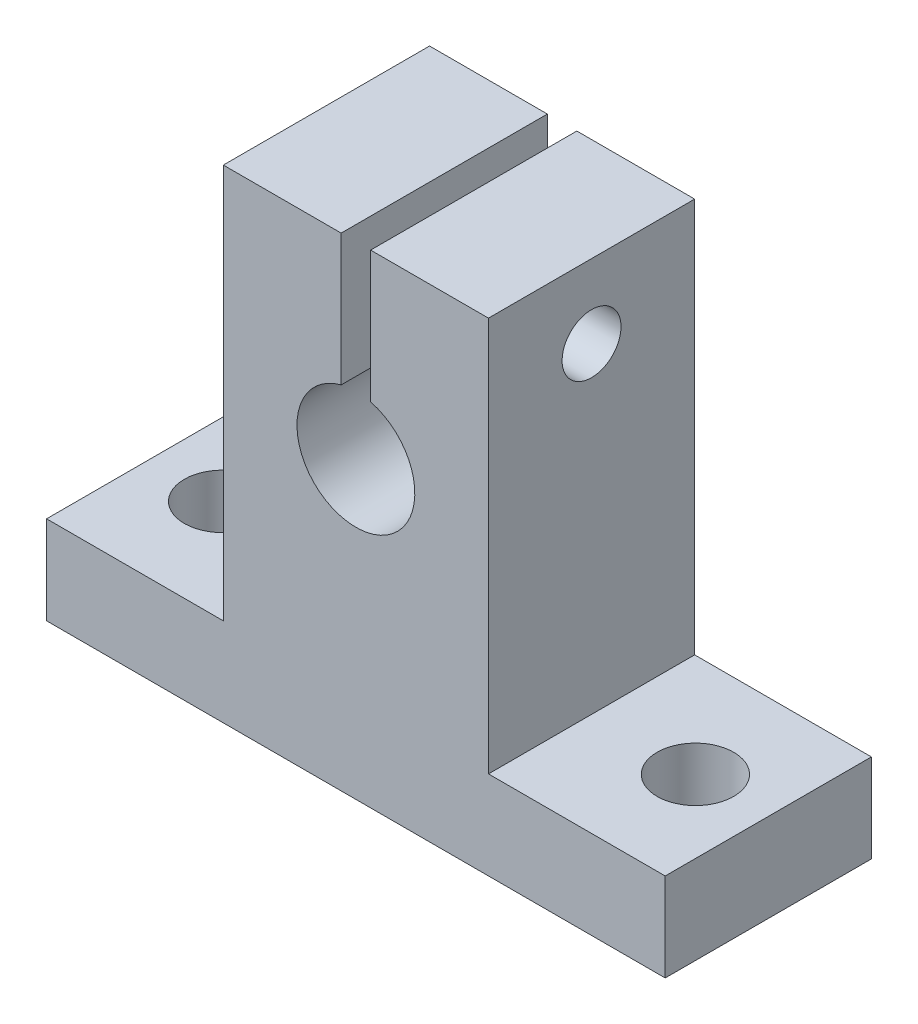
ISO-10303-21;
HEADER;
FILE_DESCRIPTION(('STEP AP214'),'2;1');
FILE_NAME('part.step','',(''),(''),'','','');
FILE_SCHEMA(('AUTOMOTIVE_DESIGN { 1 0 10303 214 1 1 1 1 }'));
ENDSEC;
DATA;
#1=APPLICATION_CONTEXT('core data for automotive mechanical design processes');
#2=APPLICATION_PROTOCOL_DEFINITION('international standard','automotive_design',2000,#1);
#3=PRODUCT_CONTEXT('',#1,'mechanical');
#4=PRODUCT('Part','Part','',(#3));
#5=PRODUCT_RELATED_PRODUCT_CATEGORY('part','',(#4));
#6=PRODUCT_DEFINITION_FORMATION('','',#4);
#7=PRODUCT_DEFINITION_CONTEXT('part definition',#1,'design');
#8=PRODUCT_DEFINITION('design','',#6,#7);
#9=PRODUCT_DEFINITION_SHAPE('','',#8);
#10=(LENGTH_UNIT() NAMED_UNIT(*) SI_UNIT(.MILLI.,.METRE.));
#11=(NAMED_UNIT(*) PLANE_ANGLE_UNIT() SI_UNIT($,.RADIAN.));
#12=(NAMED_UNIT(*) SI_UNIT($,.STERADIAN.) SOLID_ANGLE_UNIT());
#13=UNCERTAINTY_MEASURE_WITH_UNIT(LENGTH_MEASURE(1.E-05),#10,'distance_accuracy_value','');
#14=(GEOMETRIC_REPRESENTATION_CONTEXT(3) GLOBAL_UNCERTAINTY_ASSIGNED_CONTEXT((#13)) GLOBAL_UNIT_ASSIGNED_CONTEXT((#10,
#11,#12)) REPRESENTATION_CONTEXT('',''));
#15=CARTESIAN_POINT('',(0.,0.,0.));
#16=DIRECTION('',(0.,0.,1.));
#17=DIRECTION('',(1.,0.,0.));
#18=AXIS2_PLACEMENT_3D('',#15,#16,#17);
#19=CARTESIAN_POINT('',(-9.,32.8,14.));
#20=DIRECTION('',(0.,-1.,0.));
#21=DIRECTION('',(0.,0.,-1.));
#22=AXIS2_PLACEMENT_3D('',#19,#20,#21);
#23=PLANE('',#22);
#24=DIRECTION('',(-1.,0.,0.));
#25=VECTOR('',#24,1.);
#26=CARTESIAN_POINT('',(-9.,32.8,0.));
#27=LINE('',#26,#25);
#28=CARTESIAN_POINT('',(9.,32.8,0.));
#29=VERTEX_POINT('',#28);
#30=CARTESIAN_POINT('',(1.,32.8,0.));
#31=VERTEX_POINT('',#30);
#32=EDGE_CURVE('E158',#29,#31,#27,.T.);
#33=ORIENTED_EDGE('',*,*,#32,.T.);
#34=DIRECTION('',(0.,0.,1.));
#35=VECTOR('',#34,1.);
#36=CARTESIAN_POINT('',(1.,32.8,0.));
#37=LINE('',#36,#35);
#38=CARTESIAN_POINT('',(1.,32.8,14.));
#39=VERTEX_POINT('',#38);
#40=EDGE_CURVE('E244',#31,#39,#37,.T.);
#41=ORIENTED_EDGE('',*,*,#40,.T.);
#42=DIRECTION('',(-1.,0.,0.));
#43=VECTOR('',#42,1.);
#44=CARTESIAN_POINT('',(-9.,32.8,14.));
#45=LINE('',#44,#43);
#46=CARTESIAN_POINT('',(9.,32.8,14.));
#47=VERTEX_POINT('',#46);
#48=EDGE_CURVE('E108',#47,#39,#45,.T.);
#49=ORIENTED_EDGE('',*,*,#48,.F.);
#50=DIRECTION('',(0.,0.,-1.));
#51=VECTOR('',#50,1.);
#52=CARTESIAN_POINT('',(9.,32.8,14.));
#53=LINE('',#52,#51);
#54=EDGE_CURVE('E11',#47,#29,#53,.T.);
#55=ORIENTED_EDGE('',*,*,#54,.T.);
#56=EDGE_LOOP('',(#33,#41,#49,#55));
#57=FACE_BOUND('',#56,.T.);
#58=ADVANCED_FACE('F41',(#57),#23,.F.);
#59=CARTESIAN_POINT('',(9.00000000000001,6.,14.));
#60=DIRECTION('',(-1.,0.,0.));
#61=DIRECTION('',(0.,-1.,0.));
#62=AXIS2_PLACEMENT_3D('',#59,#60,#61);
#63=PLANE('',#62);
#64=CARTESIAN_POINT('',(9.,27.8,7.));
#65=DIRECTION('',(-1.,0.,0.));
#66=DIRECTION('',(0.,-1.,0.));
#67=AXIS2_PLACEMENT_3D('',#64,#65,#66);
#68=CIRCLE('',#67,2.);
#69=CARTESIAN_POINT('',(9.,25.8,7.));
#70=VERTEX_POINT('',#69);
#71=EDGE_CURVE('E261',#70,#70,#68,.T.);
#72=ORIENTED_EDGE('',*,*,#71,.T.);
#73=EDGE_LOOP('',(#72));
#74=FACE_BOUND('',#73,.T.);
#75=DIRECTION('',(0.,1.,0.));
#76=VECTOR('',#75,1.);
#77=CARTESIAN_POINT('',(9.00000000000001,6.,0.));
#78=LINE('',#77,#76);
#79=CARTESIAN_POINT('',(9.00000000000001,6.,0.));
#80=VERTEX_POINT('',#79);
#81=EDGE_CURVE('E153',#80,#29,#78,.T.);
#82=ORIENTED_EDGE('',*,*,#81,.T.);
#83=ORIENTED_EDGE('',*,*,#54,.F.);
#84=DIRECTION('',(0.,1.,0.));
#85=VECTOR('',#84,1.);
#86=CARTESIAN_POINT('',(9.00000000000001,6.,14.));
#87=LINE('',#86,#85);
#88=CARTESIAN_POINT('',(9.00000000000001,6.,14.));
#89=VERTEX_POINT('',#88);
#90=EDGE_CURVE('E171',#89,#47,#87,.T.);
#91=ORIENTED_EDGE('',*,*,#90,.F.);
#92=DIRECTION('',(0.,0.,-1.));
#93=VECTOR('',#92,1.);
#94=CARTESIAN_POINT('',(9.00000000000001,6.,14.));
#95=LINE('',#94,#93);
#96=EDGE_CURVE('E149',#89,#80,#95,.T.);
#97=ORIENTED_EDGE('',*,*,#96,.T.);
#98=EDGE_LOOP('',(#82,#83,#91,#97));
#99=FACE_BOUND('',#98,.T.);
#100=ADVANCED_FACE('F43',(#74,#99),#63,.F.);
#101=CARTESIAN_POINT('',(-1.,32.8,14.));
#102=VERTEX_POINT('',#101);
#103=CARTESIAN_POINT('',(-9.,32.8,14.));
#104=VERTEX_POINT('',#103);
#105=EDGE_CURVE('E197',#102,#104,#45,.T.);
#106=ORIENTED_EDGE('',*,*,#105,.F.);
#107=DIRECTION('',(0.,0.,1.));
#108=VECTOR('',#107,1.);
#109=CARTESIAN_POINT('',(-1.,32.8,0.));
#110=LINE('',#109,#108);
#111=CARTESIAN_POINT('',(-1.,32.8,0.));
#112=VERTEX_POINT('',#111);
#113=EDGE_CURVE('E249',#112,#102,#110,.T.);
#114=ORIENTED_EDGE('',*,*,#113,.F.);
#115=CARTESIAN_POINT('',(-9.,32.8,0.));
#116=VERTEX_POINT('',#115);
#117=EDGE_CURVE('E156',#112,#116,#27,.T.);
#118=ORIENTED_EDGE('',*,*,#117,.T.);
#119=DIRECTION('',(0.,0.,-1.));
#120=VECTOR('',#119,1.);
#121=CARTESIAN_POINT('',(-9.,32.8,14.));
#122=LINE('',#121,#120);
#123=EDGE_CURVE('E50',#104,#116,#122,.T.);
#124=ORIENTED_EDGE('',*,*,#123,.F.);
#125=EDGE_LOOP('',(#106,#114,#118,#124));
#126=FACE_BOUND('',#125,.T.);
#127=ADVANCED_FACE('F273',(#126),#23,.F.);
#128=CARTESIAN_POINT('',(-9.,6.,14.));
#129=DIRECTION('',(1.,0.,0.));
#130=DIRECTION('',(0.,0.,-1.));
#131=AXIS2_PLACEMENT_3D('',#128,#129,#130);
#132=PLANE('',#131);
#133=CARTESIAN_POINT('',(-9.,27.8,7.));
#134=DIRECTION('',(-1.,0.,0.));
#135=DIRECTION('',(0.,0.,1.));
#136=AXIS2_PLACEMENT_3D('',#133,#134,#135);
#137=CIRCLE('',#136,2.);
#138=CARTESIAN_POINT('',(-9.,27.8,9.));
#139=VERTEX_POINT('',#138);
#140=EDGE_CURVE('E301',#139,#139,#137,.T.);
#141=ORIENTED_EDGE('',*,*,#140,.F.);
#142=EDGE_LOOP('',(#141));
#143=FACE_BOUND('',#142,.T.);
#144=DIRECTION('',(0.,-1.,0.));
#145=VECTOR('',#144,1.);
#146=CARTESIAN_POINT('',(-9.,6.,0.));
#147=LINE('',#146,#145);
#148=CARTESIAN_POINT('',(-9.,6.,0.));
#149=VERTEX_POINT('',#148);
#150=EDGE_CURVE('E161',#116,#149,#147,.T.);
#151=ORIENTED_EDGE('',*,*,#150,.T.);
#152=DIRECTION('',(0.,0.,-1.));
#153=VECTOR('',#152,1.);
#154=CARTESIAN_POINT('',(-9.,6.,14.));
#155=LINE('',#154,#153);
#156=CARTESIAN_POINT('',(-9.,6.,14.));
#157=VERTEX_POINT('',#156);
#158=EDGE_CURVE('E178',#157,#149,#155,.T.);
#159=ORIENTED_EDGE('',*,*,#158,.F.);
#160=DIRECTION('',(0.,-1.,0.));
#161=VECTOR('',#160,1.);
#162=CARTESIAN_POINT('',(-9.,6.,14.));
#163=LINE('',#162,#161);
#164=EDGE_CURVE('E199',#104,#157,#163,.T.);
#165=ORIENTED_EDGE('',*,*,#164,.F.);
#166=ORIENTED_EDGE('',*,*,#123,.T.);
#167=EDGE_LOOP('',(#151,#159,#165,#166));
#168=FACE_BOUND('',#167,.T.);
#169=ADVANCED_FACE('F276',(#143,#168),#132,.F.);
#170=CARTESIAN_POINT('',(-9.,6.,14.));
#171=DIRECTION('',(0.,-1.,0.));
#172=DIRECTION('',(1.,0.,0.));
#173=AXIS2_PLACEMENT_3D('',#170,#171,#172);
#174=PLANE('',#173);
#175=CARTESIAN_POINT('',(-16.05,6.,7.));
#176=DIRECTION('',(0.,1.,0.));
#177=DIRECTION('',(-1.,0.,0.));
#178=AXIS2_PLACEMENT_3D('',#175,#176,#177);
#179=CIRCLE('',#178,2.6);
#180=CARTESIAN_POINT('',(-18.65,6.,7.));
#181=VERTEX_POINT('',#180);
#182=EDGE_CURVE('E187',#181,#181,#179,.T.);
#183=ORIENTED_EDGE('',*,*,#182,.F.);
#184=EDGE_LOOP('',(#183));
#185=FACE_BOUND('',#184,.T.);
#186=DIRECTION('',(-1.,0.,0.));
#187=VECTOR('',#186,1.);
#188=CARTESIAN_POINT('',(-9.,6.,0.));
#189=LINE('',#188,#187);
#190=CARTESIAN_POINT('',(-21.,5.99999999999999,0.));
#191=VERTEX_POINT('',#190);
#192=EDGE_CURVE('E163',#149,#191,#189,.T.);
#193=ORIENTED_EDGE('',*,*,#192,.T.);
#194=DIRECTION('',(0.,0.,-1.));
#195=VECTOR('',#194,1.);
#196=CARTESIAN_POINT('',(-21.,5.99999999999999,14.));
#197=LINE('',#196,#195);
#198=CARTESIAN_POINT('',(-21.,5.99999999999999,14.));
#199=VERTEX_POINT('',#198);
#200=EDGE_CURVE('E175',#199,#191,#197,.T.);
#201=ORIENTED_EDGE('',*,*,#200,.F.);
#202=DIRECTION('',(-1.,0.,0.));
#203=VECTOR('',#202,1.);
#204=CARTESIAN_POINT('',(-9.,6.,14.));
#205=LINE('',#204,#203);
#206=EDGE_CURVE('E201',#157,#199,#205,.T.);
#207=ORIENTED_EDGE('',*,*,#206,.F.);
#208=ORIENTED_EDGE('',*,*,#158,.T.);
#209=EDGE_LOOP('',(#193,#201,#207,#208));
#210=FACE_BOUND('',#209,.T.);
#211=ADVANCED_FACE('F207',(#185,#210),#174,.F.);
#212=CARTESIAN_POINT('',(-21.,0.,14.));
#213=DIRECTION('',(1.,0.,0.));
#214=DIRECTION('',(0.,0.,-1.));
#215=AXIS2_PLACEMENT_3D('',#212,#213,#214);
#216=PLANE('',#215);
#217=DIRECTION('',(0.,-1.,0.));
#218=VECTOR('',#217,1.);
#219=CARTESIAN_POINT('',(-21.,0.,0.));
#220=LINE('',#219,#218);
#221=CARTESIAN_POINT('',(-21.,0.,0.));
#222=VERTEX_POINT('',#221);
#223=EDGE_CURVE('E165',#191,#222,#220,.T.);
#224=ORIENTED_EDGE('',*,*,#223,.T.);
#225=DIRECTION('',(0.,0.,-1.));
#226=VECTOR('',#225,1.);
#227=CARTESIAN_POINT('',(-21.,0.,14.));
#228=LINE('',#227,#226);
#229=CARTESIAN_POINT('',(-21.,0.,14.));
#230=VERTEX_POINT('',#229);
#231=EDGE_CURVE('E144',#230,#222,#228,.T.);
#232=ORIENTED_EDGE('',*,*,#231,.F.);
#233=DIRECTION('',(0.,-1.,0.));
#234=VECTOR('',#233,1.);
#235=CARTESIAN_POINT('',(-21.,0.,14.));
#236=LINE('',#235,#234);
#237=EDGE_CURVE('E132',#199,#230,#236,.T.);
#238=ORIENTED_EDGE('',*,*,#237,.F.);
#239=ORIENTED_EDGE('',*,*,#200,.T.);
#240=EDGE_LOOP('',(#224,#232,#238,#239));
#241=FACE_BOUND('',#240,.T.);
#242=ADVANCED_FACE('F211',(#241),#216,.F.);
#243=CARTESIAN_POINT('',(21.,0.,14.));
#244=DIRECTION('',(0.,1.,0.));
#245=DIRECTION('',(-1.,0.,0.));
#246=AXIS2_PLACEMENT_3D('',#243,#244,#245);
#247=PLANE('',#246);
#248=CARTESIAN_POINT('',(-16.05,0.,7.));
#249=DIRECTION('',(0.,1.,0.));
#250=DIRECTION('',(-1.,0.,0.));
#251=AXIS2_PLACEMENT_3D('',#248,#249,#250);
#252=CIRCLE('',#251,2.6);
#253=CARTESIAN_POINT('',(-18.65,0.,7.));
#254=VERTEX_POINT('',#253);
#255=EDGE_CURVE('E157',#254,#254,#252,.T.);
#256=ORIENTED_EDGE('',*,*,#255,.T.);
#257=EDGE_LOOP('',(#256));
#258=FACE_BOUND('',#257,.T.);
#259=CARTESIAN_POINT('',(16.05,0.,7.));
#260=DIRECTION('',(0.,1.,0.));
#261=DIRECTION('',(-1.,0.,0.));
#262=AXIS2_PLACEMENT_3D('',#259,#260,#261);
#263=CIRCLE('',#262,2.6);
#264=CARTESIAN_POINT('',(13.45,0.,7.));
#265=VERTEX_POINT('',#264);
#266=EDGE_CURVE('E183',#265,#265,#263,.T.);
#267=ORIENTED_EDGE('',*,*,#266,.T.);
#268=EDGE_LOOP('',(#267));
#269=FACE_BOUND('',#268,.T.);
#270=DIRECTION('',(1.,0.,0.));
#271=VECTOR('',#270,1.);
#272=CARTESIAN_POINT('',(21.,0.,0.));
#273=LINE('',#272,#271);
#274=CARTESIAN_POINT('',(21.,0.,0.));
#275=VERTEX_POINT('',#274);
#276=EDGE_CURVE('E141',#222,#275,#273,.T.);
#277=ORIENTED_EDGE('',*,*,#276,.T.);
#278=DIRECTION('',(0.,0.,-1.));
#279=VECTOR('',#278,1.);
#280=CARTESIAN_POINT('',(21.,0.,14.));
#281=LINE('',#280,#279);
#282=CARTESIAN_POINT('',(21.,0.,14.));
#283=VERTEX_POINT('',#282);
#284=EDGE_CURVE('E138',#283,#275,#281,.T.);
#285=ORIENTED_EDGE('',*,*,#284,.F.);
#286=DIRECTION('',(1.,0.,0.));
#287=VECTOR('',#286,1.);
#288=CARTESIAN_POINT('',(21.,0.,14.));
#289=LINE('',#288,#287);
#290=EDGE_CURVE('E125',#230,#283,#289,.T.);
#291=ORIENTED_EDGE('',*,*,#290,.F.);
#292=ORIENTED_EDGE('',*,*,#231,.T.);
#293=EDGE_LOOP('',(#277,#285,#291,#292));
#294=FACE_BOUND('',#293,.T.);
#295=ADVANCED_FACE('F139',(#258,#269,#294),#247,.F.);
#296=CARTESIAN_POINT('',(21.,0.,14.));
#297=DIRECTION('',(-1.,0.,0.));
#298=DIRECTION('',(0.,0.,1.));
#299=AXIS2_PLACEMENT_3D('',#296,#297,#298);
#300=PLANE('',#299);
#301=DIRECTION('',(0.,1.,0.));
#302=VECTOR('',#301,1.);
#303=CARTESIAN_POINT('',(21.,0.,0.));
#304=LINE('',#303,#302);
#305=CARTESIAN_POINT('',(21.,6.,0.));
#306=VERTEX_POINT('',#305);
#307=EDGE_CURVE('E168',#275,#306,#304,.T.);
#308=ORIENTED_EDGE('',*,*,#307,.T.);
#309=DIRECTION('',(0.,0.,-1.));
#310=VECTOR('',#309,1.);
#311=CARTESIAN_POINT('',(21.,6.,14.));
#312=LINE('',#311,#310);
#313=CARTESIAN_POINT('',(21.,6.,14.));
#314=VERTEX_POINT('',#313);
#315=EDGE_CURVE('E145',#314,#306,#312,.T.);
#316=ORIENTED_EDGE('',*,*,#315,.F.);
#317=DIRECTION('',(0.,1.,0.));
#318=VECTOR('',#317,1.);
#319=CARTESIAN_POINT('',(21.,0.,14.));
#320=LINE('',#319,#318);
#321=EDGE_CURVE('E129',#283,#314,#320,.T.);
#322=ORIENTED_EDGE('',*,*,#321,.F.);
#323=ORIENTED_EDGE('',*,*,#284,.T.);
#324=EDGE_LOOP('',(#308,#316,#322,#323));
#325=FACE_BOUND('',#324,.T.);
#326=ADVANCED_FACE('F147',(#325),#300,.F.);
#327=CARTESIAN_POINT('',(21.,6.,14.));
#328=DIRECTION('',(0.,-1.,0.));
#329=DIRECTION('',(0.,0.,-1.));
#330=AXIS2_PLACEMENT_3D('',#327,#328,#329);
#331=PLANE('',#330);
#332=CARTESIAN_POINT('',(16.05,6.,7.));
#333=DIRECTION('',(0.,1.,0.));
#334=DIRECTION('',(-1.,0.,0.));
#335=AXIS2_PLACEMENT_3D('',#332,#333,#334);
#336=CIRCLE('',#335,2.6);
#337=CARTESIAN_POINT('',(13.45,6.,7.));
#338=VERTEX_POINT('',#337);
#339=EDGE_CURVE('E192',#338,#338,#336,.T.);
#340=ORIENTED_EDGE('',*,*,#339,.F.);
#341=EDGE_LOOP('',(#340));
#342=FACE_BOUND('',#341,.T.);
#343=DIRECTION('',(-1.,0.,0.));
#344=VECTOR('',#343,1.);
#345=CARTESIAN_POINT('',(21.,6.,0.));
#346=LINE('',#345,#344);
#347=EDGE_CURVE('E100',#306,#80,#346,.T.);
#348=ORIENTED_EDGE('',*,*,#347,.T.);
#349=ORIENTED_EDGE('',*,*,#96,.F.);
#350=DIRECTION('',(-1.,0.,0.));
#351=VECTOR('',#350,1.);
#352=CARTESIAN_POINT('',(21.,6.,14.));
#353=LINE('',#352,#351);
#354=EDGE_CURVE('E67',#314,#89,#353,.T.);
#355=ORIENTED_EDGE('',*,*,#354,.F.);
#356=ORIENTED_EDGE('',*,*,#315,.T.);
#357=EDGE_LOOP('',(#348,#349,#355,#356));
#358=FACE_BOUND('',#357,.T.);
#359=ADVANCED_FACE('F216',(#342,#358),#331,.F.);
#360=CARTESIAN_POINT('',(0.,0.,14.));
#361=DIRECTION('',(0.,0.,-1.));
#362=DIRECTION('',(-1.,0.,0.));
#363=AXIS2_PLACEMENT_3D('',#360,#361,#362);
#364=PLANE('',#363);
#365=ORIENTED_EDGE('',*,*,#48,.T.);
#366=DIRECTION('',(0.,1.,0.));
#367=VECTOR('',#366,1.);
#368=CARTESIAN_POINT('',(1.,32.8,14.));
#369=LINE('',#368,#367);
#370=CARTESIAN_POINT('',(1.,23.8729833462074,14.));
#371=VERTEX_POINT('',#370);
#372=EDGE_CURVE('E224',#371,#39,#369,.T.);
#373=ORIENTED_EDGE('',*,*,#372,.F.);
#374=CARTESIAN_POINT('',(0.,20.,14.));
#375=DIRECTION('',(0.,0.,1.));
#376=DIRECTION('',(1.,0.,0.));
#377=AXIS2_PLACEMENT_3D('',#374,#375,#376);
#378=CIRCLE('',#377,4.00000000000003);
#379=CARTESIAN_POINT('',(-1.,23.8729833462074,14.));
#380=VERTEX_POINT('',#379);
#381=EDGE_CURVE('E243',#380,#371,#378,.T.);
#382=ORIENTED_EDGE('',*,*,#381,.F.);
#383=DIRECTION('',(0.,-1.,0.));
#384=VECTOR('',#383,1.);
#385=CARTESIAN_POINT('',(-1.,23.8729833462074,14.));
#386=LINE('',#385,#384);
#387=EDGE_CURVE('E258',#102,#380,#386,.T.);
#388=ORIENTED_EDGE('',*,*,#387,.F.);
#389=ORIENTED_EDGE('',*,*,#105,.T.);
#390=ORIENTED_EDGE('',*,*,#164,.T.);
#391=ORIENTED_EDGE('',*,*,#206,.T.);
#392=ORIENTED_EDGE('',*,*,#237,.T.);
#393=ORIENTED_EDGE('',*,*,#290,.T.);
#394=ORIENTED_EDGE('',*,*,#321,.T.);
#395=ORIENTED_EDGE('',*,*,#354,.T.);
#396=ORIENTED_EDGE('',*,*,#90,.T.);
#397=EDGE_LOOP('',(#365,#373,#382,#388,#389,#390,#391,#392,#393,#394,#395,#396));
#398=FACE_BOUND('',#397,.T.);
#399=ADVANCED_FACE('F127',(#398),#364,.F.);
#400=CARTESIAN_POINT('',(0.,0.,0.));
#401=DIRECTION('',(0.,0.,-1.));
#402=DIRECTION('',(-1.,0.,0.));
#403=AXIS2_PLACEMENT_3D('',#400,#401,#402);
#404=PLANE('',#403);
#405=DIRECTION('',(0.,1.,0.));
#406=VECTOR('',#405,1.);
#407=CARTESIAN_POINT('',(1.,32.8,0.));
#408=LINE('',#407,#406);
#409=CARTESIAN_POINT('',(1.,23.8729833462074,0.));
#410=VERTEX_POINT('',#409);
#411=EDGE_CURVE('E247',#410,#31,#408,.T.);
#412=ORIENTED_EDGE('',*,*,#411,.T.);
#413=ORIENTED_EDGE('',*,*,#32,.F.);
#414=ORIENTED_EDGE('',*,*,#81,.F.);
#415=ORIENTED_EDGE('',*,*,#347,.F.);
#416=ORIENTED_EDGE('',*,*,#307,.F.);
#417=ORIENTED_EDGE('',*,*,#276,.F.);
#418=ORIENTED_EDGE('',*,*,#223,.F.);
#419=ORIENTED_EDGE('',*,*,#192,.F.);
#420=ORIENTED_EDGE('',*,*,#150,.F.);
#421=ORIENTED_EDGE('',*,*,#117,.F.);
#422=DIRECTION('',(0.,-1.,0.));
#423=VECTOR('',#422,1.);
#424=CARTESIAN_POINT('',(-1.,23.8729833462074,0.));
#425=LINE('',#424,#423);
#426=CARTESIAN_POINT('',(-1.,23.8729833462074,0.));
#427=VERTEX_POINT('',#426);
#428=EDGE_CURVE('E253',#112,#427,#425,.T.);
#429=ORIENTED_EDGE('',*,*,#428,.T.);
#430=CARTESIAN_POINT('',(0.,20.,0.));
#431=DIRECTION('',(0.,0.,1.));
#432=DIRECTION('',(1.,0.,0.));
#433=AXIS2_PLACEMENT_3D('',#430,#431,#432);
#434=CIRCLE('',#433,4.00000000000003);
#435=EDGE_CURVE('E58',#427,#410,#434,.T.);
#436=ORIENTED_EDGE('',*,*,#435,.T.);
#437=EDGE_LOOP('',(#412,#413,#414,#415,#416,#417,#418,#419,#420,#421,#429,#436));
#438=FACE_BOUND('',#437,.T.);
#439=ADVANCED_FACE('F214',(#438),#404,.T.);
#440=CARTESIAN_POINT('',(16.05,-8.,7.));
#441=DIRECTION('',(0.,1.,0.));
#442=DIRECTION('',(-1.,0.,0.));
#443=AXIS2_PLACEMENT_3D('',#440,#441,#442);
#444=CYLINDRICAL_SURFACE('',#443,2.6);
#445=ORIENTED_EDGE('',*,*,#339,.T.);
#446=EDGE_LOOP('',(#445));
#447=FACE_BOUND('',#446,.T.);
#448=ORIENTED_EDGE('',*,*,#266,.F.);
#449=EDGE_LOOP('',(#448));
#450=FACE_BOUND('',#449,.T.);
#451=ADVANCED_FACE('F327',(#447,#450),#444,.F.);
#452=CARTESIAN_POINT('',(-16.05,-8.,7.));
#453=DIRECTION('',(0.,1.,0.));
#454=DIRECTION('',(-1.,0.,0.));
#455=AXIS2_PLACEMENT_3D('',#452,#453,#454);
#456=CYLINDRICAL_SURFACE('',#455,2.6);
#457=ORIENTED_EDGE('',*,*,#182,.T.);
#458=EDGE_LOOP('',(#457));
#459=FACE_BOUND('',#458,.T.);
#460=ORIENTED_EDGE('',*,*,#255,.F.);
#461=EDGE_LOOP('',(#460));
#462=FACE_BOUND('',#461,.T.);
#463=ADVANCED_FACE('F321',(#459,#462),#456,.F.);
#464=CARTESIAN_POINT('',(1.,32.8,0.));
#465=DIRECTION('',(1.,0.,0.));
#466=DIRECTION('',(0.,0.,-1.));
#467=AXIS2_PLACEMENT_3D('',#464,#465,#466);
#468=PLANE('',#467);
#469=CARTESIAN_POINT('',(1.,27.8,7.));
#470=DIRECTION('',(1.,0.,0.));
#471=DIRECTION('',(0.,0.,-1.));
#472=AXIS2_PLACEMENT_3D('',#469,#470,#471);
#473=CIRCLE('',#472,2.);
#474=CARTESIAN_POINT('',(1.,27.8,5.));
#475=VERTEX_POINT('',#474);
#476=EDGE_CURVE('E297',#475,#475,#473,.T.);
#477=ORIENTED_EDGE('',*,*,#476,.T.);
#478=EDGE_LOOP('',(#477));
#479=FACE_BOUND('',#478,.T.);
#480=ORIENTED_EDGE('',*,*,#372,.T.);
#481=ORIENTED_EDGE('',*,*,#40,.F.);
#482=ORIENTED_EDGE('',*,*,#411,.F.);
#483=DIRECTION('',(0.,0.,1.));
#484=VECTOR('',#483,1.);
#485=CARTESIAN_POINT('',(1.,23.8729833462074,0.));
#486=LINE('',#485,#484);
#487=EDGE_CURVE('E234',#410,#371,#486,.T.);
#488=ORIENTED_EDGE('',*,*,#487,.T.);
#489=EDGE_LOOP('',(#480,#481,#482,#488));
#490=FACE_BOUND('',#489,.T.);
#491=ADVANCED_FACE('F248',(#479,#490),#468,.F.);
#492=CARTESIAN_POINT('',(0.,20.,0.));
#493=DIRECTION('',(0.,0.,1.));
#494=DIRECTION('',(1.,0.,0.));
#495=AXIS2_PLACEMENT_3D('',#492,#493,#494);
#496=CYLINDRICAL_SURFACE('',#495,4.00000000000003);
#497=ORIENTED_EDGE('',*,*,#381,.T.);
#498=ORIENTED_EDGE('',*,*,#487,.F.);
#499=ORIENTED_EDGE('',*,*,#435,.F.);
#500=DIRECTION('',(0.,0.,1.));
#501=VECTOR('',#500,1.);
#502=CARTESIAN_POINT('',(-1.,23.8729833462074,0.));
#503=LINE('',#502,#501);
#504=EDGE_CURVE('E245',#427,#380,#503,.T.);
#505=ORIENTED_EDGE('',*,*,#504,.T.);
#506=EDGE_LOOP('',(#497,#498,#499,#505));
#507=FACE_BOUND('',#506,.T.);
#508=ADVANCED_FACE('F242',(#507),#496,.F.);
#509=CARTESIAN_POINT('',(-1.,23.8729833462074,0.));
#510=DIRECTION('',(-1.,0.,0.));
#511=DIRECTION('',(0.,0.,1.));
#512=AXIS2_PLACEMENT_3D('',#509,#510,#511);
#513=PLANE('',#512);
#514=CARTESIAN_POINT('',(-1.,27.8,7.));
#515=DIRECTION('',(-1.,0.,0.));
#516=DIRECTION('',(0.,0.,1.));
#517=AXIS2_PLACEMENT_3D('',#514,#515,#516);
#518=CIRCLE('',#517,2.);
#519=CARTESIAN_POINT('',(-1.,27.8,9.));
#520=VERTEX_POINT('',#519);
#521=EDGE_CURVE('E45',#520,#520,#518,.T.);
#522=ORIENTED_EDGE('',*,*,#521,.T.);
#523=EDGE_LOOP('',(#522));
#524=FACE_BOUND('',#523,.T.);
#525=ORIENTED_EDGE('',*,*,#387,.T.);
#526=ORIENTED_EDGE('',*,*,#504,.F.);
#527=ORIENTED_EDGE('',*,*,#428,.F.);
#528=ORIENTED_EDGE('',*,*,#113,.T.);
#529=EDGE_LOOP('',(#525,#526,#527,#528));
#530=FACE_BOUND('',#529,.T.);
#531=ADVANCED_FACE('F269',(#524,#530),#513,.F.);
#532=CARTESIAN_POINT('',(21.,27.8,7.));
#533=DIRECTION('',(-1.,0.,0.));
#534=DIRECTION('',(0.,0.,1.));
#535=AXIS2_PLACEMENT_3D('',#532,#533,#534);
#536=CYLINDRICAL_SURFACE('',#535,2.);
#537=ORIENTED_EDGE('',*,*,#140,.T.);
#538=EDGE_LOOP('',(#537));
#539=FACE_BOUND('',#538,.T.);
#540=ORIENTED_EDGE('',*,*,#521,.F.);
#541=EDGE_LOOP('',(#540));
#542=FACE_BOUND('',#541,.T.);
#543=ADVANCED_FACE('F308',(#539,#542),#536,.F.);
#544=ORIENTED_EDGE('',*,*,#476,.F.);
#545=EDGE_LOOP('',(#544));
#546=FACE_BOUND('',#545,.T.);
#547=ORIENTED_EDGE('',*,*,#71,.F.);
#548=EDGE_LOOP('',(#547));
#549=FACE_BOUND('',#548,.T.);
#550=ADVANCED_FACE('F310',(#546,#549),#536,.F.);
#551=CLOSED_SHELL('',(#58,#100,#127,#169,#211,#242,#295,#326,#359,#399,#439,#451,#463,#491,#508,
#531,#543,#550));
#552=MANIFOLD_SOLID_BREP('B2',#551);
#553=ADVANCED_BREP_SHAPE_REPRESENTATION('',(#18,#552),#14);
#554=SHAPE_DEFINITION_REPRESENTATION(#9,#553);
ENDSEC;
END-ISO-10303-21;
